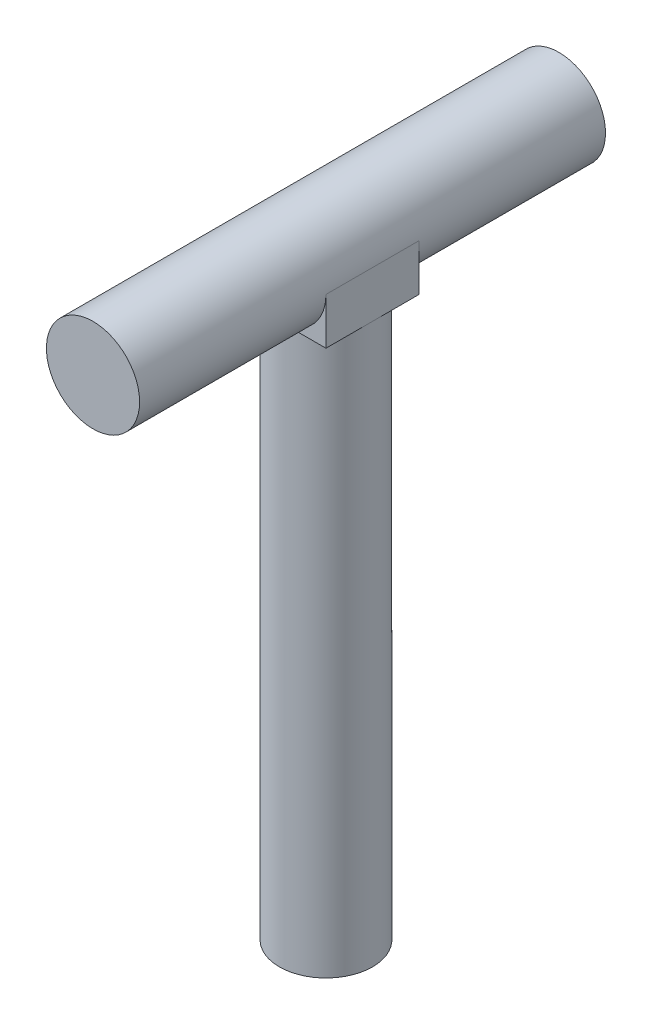
ISO-10303-21;
HEADER;
FILE_DESCRIPTION(('STEP AP214'),'2;1');
FILE_NAME('part.step','',(''),(''),'','','');
FILE_SCHEMA(('AUTOMOTIVE_DESIGN { 1 0 10303 214 1 1 1 1 }'));
ENDSEC;
DATA;
#1=APPLICATION_CONTEXT('core data for automotive mechanical design processes');
#2=APPLICATION_PROTOCOL_DEFINITION('international standard','automotive_design',2000,#1);
#3=PRODUCT_CONTEXT('',#1,'mechanical');
#4=PRODUCT('Part','Part','',(#3));
#5=PRODUCT_RELATED_PRODUCT_CATEGORY('part','',(#4));
#6=PRODUCT_DEFINITION_FORMATION('','',#4);
#7=PRODUCT_DEFINITION_CONTEXT('part definition',#1,'design');
#8=PRODUCT_DEFINITION('design','',#6,#7);
#9=PRODUCT_DEFINITION_SHAPE('','',#8);
#10=(LENGTH_UNIT() NAMED_UNIT(*) SI_UNIT(.MILLI.,.METRE.));
#11=(NAMED_UNIT(*) PLANE_ANGLE_UNIT() SI_UNIT($,.RADIAN.));
#12=(NAMED_UNIT(*) SI_UNIT($,.STERADIAN.) SOLID_ANGLE_UNIT());
#13=UNCERTAINTY_MEASURE_WITH_UNIT(LENGTH_MEASURE(1.E-05),#10,'distance_accuracy_value','');
#14=(GEOMETRIC_REPRESENTATION_CONTEXT(3) GLOBAL_UNCERTAINTY_ASSIGNED_CONTEXT((#13)) GLOBAL_UNIT_ASSIGNED_CONTEXT((#10,
#11,#12)) REPRESENTATION_CONTEXT('',''));
#15=CARTESIAN_POINT('',(0.,0.,0.));
#16=DIRECTION('',(0.,0.,1.));
#17=DIRECTION('',(1.,0.,0.));
#18=AXIS2_PLACEMENT_3D('',#15,#16,#17);
#19=CARTESIAN_POINT('',(0.,-25.4,25.4));
#20=DIRECTION('',(0.,-1.,0.));
#21=DIRECTION('',(-1.,0.,0.));
#22=AXIS2_PLACEMENT_3D('',#19,#20,#21);
#23=CYLINDRICAL_SURFACE('',#22,25.4);
#24=CARTESIAN_POINT('',(0.,-330.2,25.4));
#25=DIRECTION('',(0.,1.,0.));
#26=DIRECTION('',(-1.,0.,0.));
#27=AXIS2_PLACEMENT_3D('',#24,#25,#26);
#28=CIRCLE('',#27,25.4);
#29=CARTESIAN_POINT('',(25.4,-330.2,25.4));
#30=VERTEX_POINT('',#29);
#31=EDGE_CURVE('E11',#30,#30,#28,.T.);
#32=ORIENTED_EDGE('',*,*,#31,.T.);
#33=EDGE_LOOP('',(#32));
#34=FACE_BOUND('',#33,.T.);
#35=CARTESIAN_POINT('',(0.,-25.4,25.4));
#36=DIRECTION('',(0.,1.,0.));
#37=DIRECTION('',(-1.,0.,0.));
#38=AXIS2_PLACEMENT_3D('',#35,#36,#37);
#39=CIRCLE('',#38,25.4);
#40=CARTESIAN_POINT('',(25.4,-25.4,25.4));
#41=VERTEX_POINT('',#40);
#42=CARTESIAN_POINT('',(0.,-25.4,0.));
#43=VERTEX_POINT('',#42);
#44=EDGE_CURVE('E27',#41,#43,#39,.T.);
#45=ORIENTED_EDGE('',*,*,#44,.F.);
#46=CARTESIAN_POINT('',(0.,-25.4,25.4));
#47=DIRECTION('',(0.,1.,0.));
#48=DIRECTION('',(-1.,0.,0.));
#49=AXIS2_PLACEMENT_3D('',#46,#47,#48);
#50=CIRCLE('',#49,25.4);
#51=CARTESIAN_POINT('',(0.,-25.4,50.8));
#52=VERTEX_POINT('',#51);
#53=EDGE_CURVE('E121',#52,#41,#50,.T.);
#54=ORIENTED_EDGE('',*,*,#53,.F.);
#55=CARTESIAN_POINT('',(0.,-25.4,25.4));
#56=DIRECTION('',(0.,1.,0.));
#57=DIRECTION('',(-1.,0.,0.));
#58=AXIS2_PLACEMENT_3D('',#55,#56,#57);
#59=CIRCLE('',#58,25.4);
#60=CARTESIAN_POINT('',(-25.4,-25.4,25.4));
#61=VERTEX_POINT('',#60);
#62=EDGE_CURVE('E120',#61,#52,#59,.T.);
#63=ORIENTED_EDGE('',*,*,#62,.F.);
#64=CARTESIAN_POINT('',(0.,-25.4,25.4));
#65=DIRECTION('',(0.,1.,0.));
#66=DIRECTION('',(-1.,0.,0.));
#67=AXIS2_PLACEMENT_3D('',#64,#65,#66);
#68=CIRCLE('',#67,25.4);
#69=EDGE_CURVE('E133',#43,#61,#68,.T.);
#70=ORIENTED_EDGE('',*,*,#69,.F.);
#71=EDGE_LOOP('',(#45,#54,#63,#70));
#72=FACE_BOUND('',#71,.T.);
#73=ADVANCED_FACE('F17',(#34,#72),#23,.T.);
#74=CARTESIAN_POINT('',(0.,-330.2,25.4));
#75=DIRECTION('',(0.,1.,0.));
#76=DIRECTION('',(0.707106781186548,0.,0.707106781186548));
#77=AXIS2_PLACEMENT_3D('',#74,#75,#76);
#78=PLANE('',#77);
#79=ORIENTED_EDGE('',*,*,#31,.F.);
#80=EDGE_LOOP('',(#79));
#81=FACE_BOUND('',#80,.T.);
#82=ADVANCED_FACE('F176',(#81),#78,.F.);
#83=CARTESIAN_POINT('',(25.4,-25.4,0.));
#84=DIRECTION('',(0.,-1.,0.));
#85=DIRECTION('',(0.707106781186548,0.,0.707106781186548));
#86=AXIS2_PLACEMENT_3D('',#83,#84,#85);
#87=PLANE('',#86);
#88=ORIENTED_EDGE('',*,*,#44,.T.);
#89=DIRECTION('',(1.,0.,0.));
#90=VECTOR('',#89,1.);
#91=CARTESIAN_POINT('',(-25.4,-25.4,0.));
#92=LINE('',#91,#90);
#93=CARTESIAN_POINT('',(25.4,-25.4,0.));
#94=VERTEX_POINT('',#93);
#95=EDGE_CURVE('E86',#43,#94,#92,.T.);
#96=ORIENTED_EDGE('',*,*,#95,.T.);
#97=DIRECTION('',(0.,0.,1.));
#98=VECTOR('',#97,1.);
#99=CARTESIAN_POINT('',(25.4,-25.4,0.));
#100=LINE('',#99,#98);
#101=EDGE_CURVE('E101',#94,#41,#100,.T.);
#102=ORIENTED_EDGE('',*,*,#101,.T.);
#103=EDGE_LOOP('',(#88,#96,#102));
#104=FACE_BOUND('',#103,.T.);
#105=ADVANCED_FACE('F182',(#104),#87,.T.);
#106=CARTESIAN_POINT('',(25.4,-25.4,0.));
#107=DIRECTION('',(0.,-1.,0.));
#108=DIRECTION('',(0.707106781186548,0.,0.707106781186548));
#109=AXIS2_PLACEMENT_3D('',#106,#107,#108);
#110=PLANE('',#109);
#111=ORIENTED_EDGE('',*,*,#69,.T.);
#112=DIRECTION('',(0.,0.,1.));
#113=VECTOR('',#112,1.);
#114=CARTESIAN_POINT('',(-25.4,-25.4,0.));
#115=LINE('',#114,#113);
#116=CARTESIAN_POINT('',(-25.4,-25.4,0.));
#117=VERTEX_POINT('',#116);
#118=EDGE_CURVE('E141',#117,#61,#115,.T.);
#119=ORIENTED_EDGE('',*,*,#118,.F.);
#120=DIRECTION('',(1.,0.,0.));
#121=VECTOR('',#120,1.);
#122=CARTESIAN_POINT('',(-25.4,-25.4,0.));
#123=LINE('',#122,#121);
#124=EDGE_CURVE('E130',#117,#43,#123,.T.);
#125=ORIENTED_EDGE('',*,*,#124,.T.);
#126=EDGE_LOOP('',(#111,#119,#125));
#127=FACE_BOUND('',#126,.T.);
#128=ADVANCED_FACE('F187',(#127),#110,.T.);
#129=CARTESIAN_POINT('',(25.4,-25.4,0.));
#130=DIRECTION('',(0.,-1.,0.));
#131=DIRECTION('',(0.707106781186548,0.,0.707106781186548));
#132=AXIS2_PLACEMENT_3D('',#129,#130,#131);
#133=PLANE('',#132);
#134=ORIENTED_EDGE('',*,*,#62,.T.);
#135=DIRECTION('',(-1.,0.,0.));
#136=VECTOR('',#135,1.);
#137=CARTESIAN_POINT('',(-25.4,-25.4,50.8));
#138=LINE('',#137,#136);
#139=CARTESIAN_POINT('',(-25.4,-25.4,50.8));
#140=VERTEX_POINT('',#139);
#141=EDGE_CURVE('E116',#52,#140,#138,.T.);
#142=ORIENTED_EDGE('',*,*,#141,.T.);
#143=DIRECTION('',(0.,0.,1.));
#144=VECTOR('',#143,1.);
#145=CARTESIAN_POINT('',(-25.4,-25.4,0.));
#146=LINE('',#145,#144);
#147=EDGE_CURVE('E125',#61,#140,#146,.T.);
#148=ORIENTED_EDGE('',*,*,#147,.F.);
#149=EDGE_LOOP('',(#134,#142,#148));
#150=FACE_BOUND('',#149,.T.);
#151=ADVANCED_FACE('F124',(#150),#133,.T.);
#152=CARTESIAN_POINT('',(25.4,-25.4,0.));
#153=DIRECTION('',(0.,-1.,0.));
#154=DIRECTION('',(0.707106781186548,0.,0.707106781186548));
#155=AXIS2_PLACEMENT_3D('',#152,#153,#154);
#156=PLANE('',#155);
#157=ORIENTED_EDGE('',*,*,#53,.T.);
#158=DIRECTION('',(0.,0.,1.));
#159=VECTOR('',#158,1.);
#160=CARTESIAN_POINT('',(25.4,-25.4,0.));
#161=LINE('',#160,#159);
#162=CARTESIAN_POINT('',(25.4,-25.4,50.8));
#163=VERTEX_POINT('',#162);
#164=EDGE_CURVE('E145',#41,#163,#161,.T.);
#165=ORIENTED_EDGE('',*,*,#164,.T.);
#166=DIRECTION('',(-1.,0.,0.));
#167=VECTOR('',#166,1.);
#168=CARTESIAN_POINT('',(-25.4,-25.4,50.8));
#169=LINE('',#168,#167);
#170=EDGE_CURVE('E148',#163,#52,#169,.T.);
#171=ORIENTED_EDGE('',*,*,#170,.T.);
#172=EDGE_LOOP('',(#157,#165,#171));
#173=FACE_BOUND('',#172,.T.);
#174=ADVANCED_FACE('F194',(#173),#156,.T.);
#175=CARTESIAN_POINT('',(0.,0.,-101.6));
#176=DIRECTION('',(0.,0.,1.));
#177=DIRECTION('',(0.707106781186548,0.707106781186548,0.));
#178=AXIS2_PLACEMENT_3D('',#175,#176,#177);
#179=PLANE('',#178);
#180=CARTESIAN_POINT('',(0.,0.,-101.6));
#181=DIRECTION('',(0.,0.,1.));
#182=DIRECTION('',(1.,0.,0.));
#183=AXIS2_PLACEMENT_3D('',#180,#181,#182);
#184=CIRCLE('',#183,25.4);
#185=CARTESIAN_POINT('',(-25.4,0.,-101.6));
#186=VERTEX_POINT('',#185);
#187=EDGE_CURVE('E144',#186,#186,#184,.T.);
#188=ORIENTED_EDGE('',*,*,#187,.F.);
#189=EDGE_LOOP('',(#188));
#190=FACE_BOUND('',#189,.T.);
#191=ADVANCED_FACE('F172',(#190),#179,.F.);
#192=CARTESIAN_POINT('',(0.,-4.2565628971306,0.));
#193=DIRECTION('',(0.,0.,1.));
#194=DIRECTION('',(0.707106781186548,0.707106781186548,0.));
#195=AXIS2_PLACEMENT_3D('',#192,#193,#194);
#196=PLANE('',#195);
#197=CARTESIAN_POINT('',(0.,0.,0.));
#198=DIRECTION('',(0.,0.,1.));
#199=DIRECTION('',(1.,0.,0.));
#200=AXIS2_PLACEMENT_3D('',#197,#198,#199);
#201=CIRCLE('',#200,25.4);
#202=CARTESIAN_POINT('',(-25.4,0.,0.));
#203=VERTEX_POINT('',#202);
#204=EDGE_CURVE('E151',#203,#43,#201,.T.);
#205=ORIENTED_EDGE('',*,*,#204,.T.);
#206=ORIENTED_EDGE('',*,*,#124,.F.);
#207=DIRECTION('',(0.,-1.,0.));
#208=VECTOR('',#207,1.);
#209=CARTESIAN_POINT('',(-25.4,0.,0.));
#210=LINE('',#209,#208);
#211=EDGE_CURVE('E110',#203,#117,#210,.T.);
#212=ORIENTED_EDGE('',*,*,#211,.F.);
#213=EDGE_LOOP('',(#205,#206,#212));
#214=FACE_BOUND('',#213,.T.);
#215=ADVANCED_FACE('F162',(#214),#196,.F.);
#216=CARTESIAN_POINT('',(0.,0.,152.4));
#217=DIRECTION('',(0.,0.,-1.));
#218=DIRECTION('',(0.707106781186548,0.707106781186548,0.));
#219=AXIS2_PLACEMENT_3D('',#216,#217,#218);
#220=PLANE('',#219);
#221=CARTESIAN_POINT('',(0.,0.,152.4));
#222=DIRECTION('',(0.,0.,-1.));
#223=DIRECTION('',(-1.,0.,0.));
#224=AXIS2_PLACEMENT_3D('',#221,#222,#223);
#225=CIRCLE('',#224,25.4);
#226=CARTESIAN_POINT('',(25.4,0.,152.4));
#227=VERTEX_POINT('',#226);
#228=EDGE_CURVE('E104',#227,#227,#225,.T.);
#229=ORIENTED_EDGE('',*,*,#228,.F.);
#230=EDGE_LOOP('',(#229));
#231=FACE_BOUND('',#230,.T.);
#232=ADVANCED_FACE('F159',(#231),#220,.F.);
#233=CARTESIAN_POINT('',(0.,-4.2565628971306,50.8));
#234=DIRECTION('',(0.,0.,1.));
#235=DIRECTION('',(0.707106781186548,0.707106781186548,0.));
#236=AXIS2_PLACEMENT_3D('',#233,#234,#235);
#237=PLANE('',#236);
#238=CARTESIAN_POINT('',(0.,0.,50.8));
#239=DIRECTION('',(0.,0.,-1.));
#240=DIRECTION('',(-1.,0.,0.));
#241=AXIS2_PLACEMENT_3D('',#238,#239,#240);
#242=CIRCLE('',#241,25.4);
#243=CARTESIAN_POINT('',(25.4,0.,50.8));
#244=VERTEX_POINT('',#243);
#245=EDGE_CURVE('E94',#244,#52,#242,.T.);
#246=ORIENTED_EDGE('',*,*,#245,.T.);
#247=ORIENTED_EDGE('',*,*,#170,.F.);
#248=DIRECTION('',(0.,-1.,0.));
#249=VECTOR('',#248,1.);
#250=CARTESIAN_POINT('',(25.4,-25.4,50.8));
#251=LINE('',#250,#249);
#252=EDGE_CURVE('E102',#244,#163,#251,.T.);
#253=ORIENTED_EDGE('',*,*,#252,.F.);
#254=EDGE_LOOP('',(#246,#247,#253));
#255=FACE_BOUND('',#254,.T.);
#256=ADVANCED_FACE('F161',(#255),#237,.T.);
#257=CARTESIAN_POINT('',(-25.4,-25.4,0.));
#258=DIRECTION('',(-1.,0.,0.));
#259=DIRECTION('',(0.,0.707106781186548,0.707106781186548));
#260=AXIS2_PLACEMENT_3D('',#257,#258,#259);
#261=PLANE('',#260);
#262=DIRECTION('',(0.,1.,0.));
#263=VECTOR('',#262,1.);
#264=CARTESIAN_POINT('',(-25.4,0.,50.8));
#265=LINE('',#264,#263);
#266=CARTESIAN_POINT('',(-25.4,0.,50.8));
#267=VERTEX_POINT('',#266);
#268=EDGE_CURVE('E109',#140,#267,#265,.T.);
#269=ORIENTED_EDGE('',*,*,#268,.T.);
#270=DIRECTION('',(0.,0.,1.));
#271=VECTOR('',#270,1.);
#272=CARTESIAN_POINT('',(-25.4,0.,0.));
#273=LINE('',#272,#271);
#274=EDGE_CURVE('E74',#203,#267,#273,.T.);
#275=ORIENTED_EDGE('',*,*,#274,.F.);
#276=ORIENTED_EDGE('',*,*,#211,.T.);
#277=ORIENTED_EDGE('',*,*,#118,.T.);
#278=ORIENTED_EDGE('',*,*,#147,.T.);
#279=EDGE_LOOP('',(#269,#275,#276,#277,#278));
#280=FACE_BOUND('',#279,.T.);
#281=ADVANCED_FACE('F169',(#280),#261,.T.);
#282=CARTESIAN_POINT('',(0.,0.,0.));
#283=DIRECTION('',(0.,0.,1.));
#284=DIRECTION('',(1.,0.,0.));
#285=AXIS2_PLACEMENT_3D('',#282,#283,#284);
#286=CYLINDRICAL_SURFACE('',#285,25.4);
#287=ORIENTED_EDGE('',*,*,#187,.T.);
#288=EDGE_LOOP('',(#287));
#289=FACE_BOUND('',#288,.T.);
#290=ORIENTED_EDGE('',*,*,#228,.T.);
#291=EDGE_LOOP('',(#290));
#292=FACE_BOUND('',#291,.T.);
#293=DIRECTION('',(0.,0.,1.));
#294=VECTOR('',#293,1.);
#295=CARTESIAN_POINT('',(25.4,0.,0.));
#296=LINE('',#295,#294);
#297=CARTESIAN_POINT('',(25.4,0.,0.));
#298=VERTEX_POINT('',#297);
#299=EDGE_CURVE('E88',#298,#244,#296,.T.);
#300=ORIENTED_EDGE('',*,*,#299,.F.);
#301=CARTESIAN_POINT('',(0.,0.,0.));
#302=DIRECTION('',(0.,0.,1.));
#303=DIRECTION('',(1.,0.,0.));
#304=AXIS2_PLACEMENT_3D('',#301,#302,#303);
#305=CIRCLE('',#304,25.4);
#306=EDGE_CURVE('E81',#43,#298,#305,.T.);
#307=ORIENTED_EDGE('',*,*,#306,.F.);
#308=ORIENTED_EDGE('',*,*,#204,.F.);
#309=ORIENTED_EDGE('',*,*,#274,.T.);
#310=CARTESIAN_POINT('',(0.,0.,50.8));
#311=DIRECTION('',(0.,0.,-1.));
#312=DIRECTION('',(-1.,0.,0.));
#313=AXIS2_PLACEMENT_3D('',#310,#311,#312);
#314=CIRCLE('',#313,25.4);
#315=EDGE_CURVE('E89',#52,#267,#314,.T.);
#316=ORIENTED_EDGE('',*,*,#315,.F.);
#317=ORIENTED_EDGE('',*,*,#245,.F.);
#318=EDGE_LOOP('',(#300,#307,#308,#309,#316,#317));
#319=FACE_BOUND('',#318,.T.);
#320=ADVANCED_FACE('F93',(#289,#292,#319),#286,.T.);
#321=CARTESIAN_POINT('',(25.4,0.,0.));
#322=DIRECTION('',(1.,0.,0.));
#323=DIRECTION('',(0.,0.707106781186548,0.707106781186548));
#324=AXIS2_PLACEMENT_3D('',#321,#322,#323);
#325=PLANE('',#324);
#326=ORIENTED_EDGE('',*,*,#252,.T.);
#327=ORIENTED_EDGE('',*,*,#164,.F.);
#328=ORIENTED_EDGE('',*,*,#101,.F.);
#329=DIRECTION('',(0.,1.,0.));
#330=VECTOR('',#329,1.);
#331=CARTESIAN_POINT('',(25.4,-25.4,0.));
#332=LINE('',#331,#330);
#333=EDGE_CURVE('E21',#94,#298,#332,.T.);
#334=ORIENTED_EDGE('',*,*,#333,.T.);
#335=ORIENTED_EDGE('',*,*,#299,.T.);
#336=EDGE_LOOP('',(#326,#327,#328,#334,#335));
#337=FACE_BOUND('',#336,.T.);
#338=ADVANCED_FACE('F98',(#337),#325,.T.);
#339=CARTESIAN_POINT('',(0.,-4.2565628971306,0.));
#340=DIRECTION('',(0.,0.,1.));
#341=DIRECTION('',(0.707106781186548,0.707106781186548,0.));
#342=AXIS2_PLACEMENT_3D('',#339,#340,#341);
#343=PLANE('',#342);
#344=ORIENTED_EDGE('',*,*,#306,.T.);
#345=ORIENTED_EDGE('',*,*,#333,.F.);
#346=ORIENTED_EDGE('',*,*,#95,.F.);
#347=EDGE_LOOP('',(#344,#345,#346));
#348=FACE_BOUND('',#347,.T.);
#349=ADVANCED_FACE('F83',(#348),#343,.F.);
#350=CARTESIAN_POINT('',(0.,-4.2565628971306,50.8));
#351=DIRECTION('',(0.,0.,1.));
#352=DIRECTION('',(0.707106781186548,0.707106781186548,0.));
#353=AXIS2_PLACEMENT_3D('',#350,#351,#352);
#354=PLANE('',#353);
#355=ORIENTED_EDGE('',*,*,#315,.T.);
#356=ORIENTED_EDGE('',*,*,#268,.F.);
#357=ORIENTED_EDGE('',*,*,#141,.F.);
#358=EDGE_LOOP('',(#355,#356,#357));
#359=FACE_BOUND('',#358,.T.);
#360=ADVANCED_FACE('F19',(#359),#354,.T.);
#361=CLOSED_SHELL('',(#73,#82,#105,#128,#151,#174,#191,#215,#232,#256,#281,#320,#338,#349,#360));
#362=MANIFOLD_SOLID_BREP('B1',#361);
#363=ADVANCED_BREP_SHAPE_REPRESENTATION('',(#18,#362),#14);
#364=SHAPE_DEFINITION_REPRESENTATION(#9,#363);
ENDSEC;
END-ISO-10303-21;
